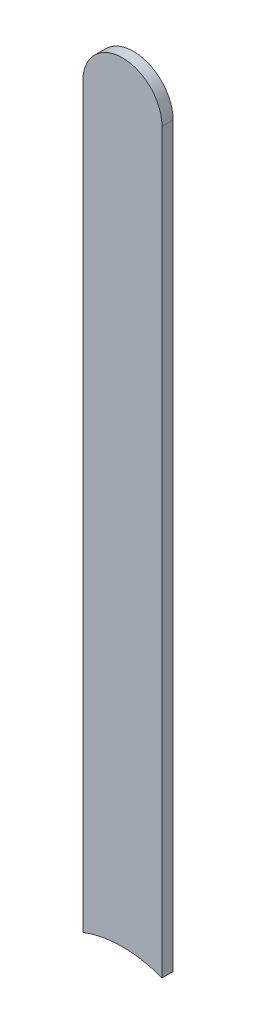
ISO-10303-21;
HEADER;
FILE_DESCRIPTION(('STEP AP214'),'2;1');
FILE_NAME('part.step','',(''),(''),'','','');
FILE_SCHEMA(('AUTOMOTIVE_DESIGN { 1 0 10303 214 1 1 1 1 }'));
ENDSEC;
DATA;
#1=APPLICATION_CONTEXT('core data for automotive mechanical design processes');
#2=APPLICATION_PROTOCOL_DEFINITION('international standard','automotive_design',2000,#1);
#3=PRODUCT_CONTEXT('',#1,'mechanical');
#4=PRODUCT('Part','Part','',(#3));
#5=PRODUCT_RELATED_PRODUCT_CATEGORY('part','',(#4));
#6=PRODUCT_DEFINITION_FORMATION('','',#4);
#7=PRODUCT_DEFINITION_CONTEXT('part definition',#1,'design');
#8=PRODUCT_DEFINITION('design','',#6,#7);
#9=PRODUCT_DEFINITION_SHAPE('','',#8);
#10=(LENGTH_UNIT() NAMED_UNIT(*) SI_UNIT(.MILLI.,.METRE.));
#11=(NAMED_UNIT(*) PLANE_ANGLE_UNIT() SI_UNIT($,.RADIAN.));
#12=(NAMED_UNIT(*) SI_UNIT($,.STERADIAN.) SOLID_ANGLE_UNIT());
#13=UNCERTAINTY_MEASURE_WITH_UNIT(LENGTH_MEASURE(1.E-05),#10,'distance_accuracy_value','');
#14=(GEOMETRIC_REPRESENTATION_CONTEXT(3) GLOBAL_UNCERTAINTY_ASSIGNED_CONTEXT((#13)) GLOBAL_UNIT_ASSIGNED_CONTEXT((#10,
#11,#12)) REPRESENTATION_CONTEXT('',''));
#15=CARTESIAN_POINT('',(0.,0.,0.));
#16=DIRECTION('',(0.,0.,1.));
#17=DIRECTION('',(1.,0.,0.));
#18=AXIS2_PLACEMENT_3D('',#15,#16,#17);
#19=CARTESIAN_POINT('',(87.64397254,90.9191221194978,0.));
#20=DIRECTION('',(-1.,0.,0.));
#21=DIRECTION('',(0.,1.,0.));
#22=AXIS2_PLACEMENT_3D('',#19,#20,#21);
#23=PLANE('',#22);
#24=DIRECTION('',(0.,1.,0.));
#25=VECTOR('',#24,1.);
#26=CARTESIAN_POINT('',(87.64397254,90.58697402,0.03556));
#27=LINE('',#26,#25);
#28=CARTESIAN_POINT('',(87.64397254,90.9191221194978,0.03556));
#29=VERTEX_POINT('',#28);
#30=CARTESIAN_POINT('',(87.64397254,93.2869737,0.03556));
#31=VERTEX_POINT('',#30);
#32=EDGE_CURVE('E11',#29,#31,#27,.T.);
#33=ORIENTED_EDGE('',*,*,#32,.F.);
#34=DIRECTION('',(0.,0.,1.));
#35=VECTOR('',#34,1.);
#36=CARTESIAN_POINT('',(87.64397254,90.9191221194978,0.));
#37=LINE('',#36,#35);
#38=CARTESIAN_POINT('',(87.64397254,90.9191221194978,0.));
#39=VERTEX_POINT('',#38);
#40=EDGE_CURVE('E24',#39,#29,#37,.T.);
#41=ORIENTED_EDGE('',*,*,#40,.F.);
#42=DIRECTION('',(0.,1.,0.));
#43=VECTOR('',#42,1.);
#44=CARTESIAN_POINT('',(87.64397254,90.58697402,0.));
#45=LINE('',#44,#43);
#46=CARTESIAN_POINT('',(87.64397254,93.2869737,0.));
#47=VERTEX_POINT('',#46);
#48=EDGE_CURVE('E75',#39,#47,#45,.T.);
#49=ORIENTED_EDGE('',*,*,#48,.T.);
#50=DIRECTION('',(0.,0.,1.));
#51=VECTOR('',#50,1.);
#52=CARTESIAN_POINT('',(87.64397254,93.2869737,0.));
#53=LINE('',#52,#51);
#54=EDGE_CURVE('E37',#47,#31,#53,.T.);
#55=ORIENTED_EDGE('',*,*,#54,.T.);
#56=EDGE_LOOP('',(#33,#41,#49,#55));
#57=FACE_BOUND('',#56,.T.);
#58=ADVANCED_FACE('F17',(#57),#23,.F.);
#59=CARTESIAN_POINT('',(87.51697254,93.2869737,0.));
#60=DIRECTION('',(0.,0.,-1.));
#61=DIRECTION('',(1.,-1.11896493820492E-13,0.));
#62=AXIS2_PLACEMENT_3D('',#59,#60,#61);
#63=CYLINDRICAL_SURFACE('',#62,0.126999999999995);
#64=CARTESIAN_POINT('',(87.51697254,93.2869737,0.03556));
#65=DIRECTION('',(0.,0.,1.));
#66=DIRECTION('',(1.,-1.11896493820492E-13,0.));
#67=AXIS2_PLACEMENT_3D('',#64,#65,#66);
#68=CIRCLE('',#67,0.126999999999995);
#69=CARTESIAN_POINT('',(87.38997254,93.2869737,0.03556));
#70=VERTEX_POINT('',#69);
#71=EDGE_CURVE('E83',#31,#70,#68,.T.);
#72=ORIENTED_EDGE('',*,*,#71,.F.);
#73=ORIENTED_EDGE('',*,*,#54,.F.);
#74=CARTESIAN_POINT('',(87.51697254,93.2869737,0.));
#75=DIRECTION('',(0.,0.,1.));
#76=DIRECTION('',(1.,-1.11896493820492E-13,0.));
#77=AXIS2_PLACEMENT_3D('',#74,#75,#76);
#78=CIRCLE('',#77,0.126999999999995);
#79=CARTESIAN_POINT('',(87.38997254,93.2869737,0.));
#80=VERTEX_POINT('',#79);
#81=EDGE_CURVE('E81',#47,#80,#78,.T.);
#82=ORIENTED_EDGE('',*,*,#81,.T.);
#83=DIRECTION('',(0.,0.,1.));
#84=VECTOR('',#83,1.);
#85=CARTESIAN_POINT('',(87.38997254,93.2869737,0.));
#86=LINE('',#85,#84);
#87=EDGE_CURVE('E67',#80,#70,#86,.T.);
#88=ORIENTED_EDGE('',*,*,#87,.T.);
#89=EDGE_LOOP('',(#72,#73,#82,#88));
#90=FACE_BOUND('',#89,.T.);
#91=ADVANCED_FACE('F89',(#90),#63,.T.);
#92=CARTESIAN_POINT('',(87.38997254,93.2869737,0.));
#93=DIRECTION('',(1.,0.,0.));
#94=DIRECTION('',(0.,-1.,0.));
#95=AXIS2_PLACEMENT_3D('',#92,#93,#94);
#96=PLANE('',#95);
#97=DIRECTION('',(0.,-1.,0.));
#98=VECTOR('',#97,1.);
#99=CARTESIAN_POINT('',(87.38997254,93.2869737,0.03556));
#100=LINE('',#99,#98);
#101=CARTESIAN_POINT('',(87.38997254,90.9191221194978,0.03556));
#102=VERTEX_POINT('',#101);
#103=EDGE_CURVE('E71',#70,#102,#100,.T.);
#104=ORIENTED_EDGE('',*,*,#103,.F.);
#105=ORIENTED_EDGE('',*,*,#87,.F.);
#106=DIRECTION('',(0.,-1.,0.));
#107=VECTOR('',#106,1.);
#108=CARTESIAN_POINT('',(87.38997254,93.2869737,0.));
#109=LINE('',#108,#107);
#110=CARTESIAN_POINT('',(87.38997254,90.9191221194978,0.));
#111=VERTEX_POINT('',#110);
#112=EDGE_CURVE('E63',#80,#111,#109,.T.);
#113=ORIENTED_EDGE('',*,*,#112,.T.);
#114=DIRECTION('',(0.,0.,1.));
#115=VECTOR('',#114,1.);
#116=CARTESIAN_POINT('',(87.38997254,90.9191221194978,0.));
#117=LINE('',#116,#115);
#118=EDGE_CURVE('E53',#111,#102,#117,.T.);
#119=ORIENTED_EDGE('',*,*,#118,.T.);
#120=EDGE_LOOP('',(#104,#105,#113,#119));
#121=FACE_BOUND('',#120,.T.);
#122=ADVANCED_FACE('F66',(#121),#96,.F.);
#123=CARTESIAN_POINT('',(87.51697254,90.58697402,0.));
#124=DIRECTION('',(0.,0.,-1.));
#125=DIRECTION('',(1.,0.,0.));
#126=AXIS2_PLACEMENT_3D('',#123,#124,#125);
#127=CYLINDRICAL_SURFACE('',#126,0.3556);
#128=ORIENTED_EDGE('',*,*,#40,.T.);
#129=CARTESIAN_POINT('',(87.51697254,90.58697402,0.03556));
#130=DIRECTION('',(0.,0.,1.));
#131=DIRECTION('',(1.,0.,0.));
#132=AXIS2_PLACEMENT_3D('',#129,#130,#131);
#133=CIRCLE('',#132,0.3556);
#134=EDGE_CURVE('E59',#29,#102,#133,.T.);
#135=ORIENTED_EDGE('',*,*,#134,.T.);
#136=ORIENTED_EDGE('',*,*,#118,.F.);
#137=CARTESIAN_POINT('',(87.51697254,90.58697402,0.));
#138=DIRECTION('',(0.,0.,1.));
#139=DIRECTION('',(1.,0.,0.));
#140=AXIS2_PLACEMENT_3D('',#137,#138,#139);
#141=CIRCLE('',#140,0.3556);
#142=EDGE_CURVE('E57',#39,#111,#141,.T.);
#143=ORIENTED_EDGE('',*,*,#142,.F.);
#144=EDGE_LOOP('',(#128,#135,#136,#143));
#145=FACE_BOUND('',#144,.T.);
#146=ADVANCED_FACE('F55',(#145),#127,.F.);
#147=CARTESIAN_POINT('',(87.64397254,90.58697402,0.));
#148=DIRECTION('',(0.,0.,-1.));
#149=DIRECTION('',(-1.,0.,0.));
#150=AXIS2_PLACEMENT_3D('',#147,#148,#149);
#151=PLANE('',#150);
#152=ORIENTED_EDGE('',*,*,#48,.F.);
#153=ORIENTED_EDGE('',*,*,#142,.T.);
#154=ORIENTED_EDGE('',*,*,#112,.F.);
#155=ORIENTED_EDGE('',*,*,#81,.F.);
#156=EDGE_LOOP('',(#152,#153,#154,#155));
#157=FACE_BOUND('',#156,.T.);
#158=ADVANCED_FACE('F74',(#157),#151,.T.);
#159=CARTESIAN_POINT('',(87.64397254,90.58697402,0.03556));
#160=DIRECTION('',(0.,0.,-1.));
#161=DIRECTION('',(-1.,0.,0.));
#162=AXIS2_PLACEMENT_3D('',#159,#160,#161);
#163=PLANE('',#162);
#164=ORIENTED_EDGE('',*,*,#134,.F.);
#165=ORIENTED_EDGE('',*,*,#32,.T.);
#166=ORIENTED_EDGE('',*,*,#71,.T.);
#167=ORIENTED_EDGE('',*,*,#103,.T.);
#168=EDGE_LOOP('',(#164,#165,#166,#167));
#169=FACE_BOUND('',#168,.T.);
#170=ADVANCED_FACE('F91',(#169),#163,.F.);
#171=CLOSED_SHELL('',(#58,#91,#122,#146,#158,#170));
#172=MANIFOLD_SOLID_BREP('B1',#171);
#173=ADVANCED_BREP_SHAPE_REPRESENTATION('',(#18,#172),#14);
#174=SHAPE_DEFINITION_REPRESENTATION(#9,#173);
ENDSEC;
END-ISO-10303-21;
